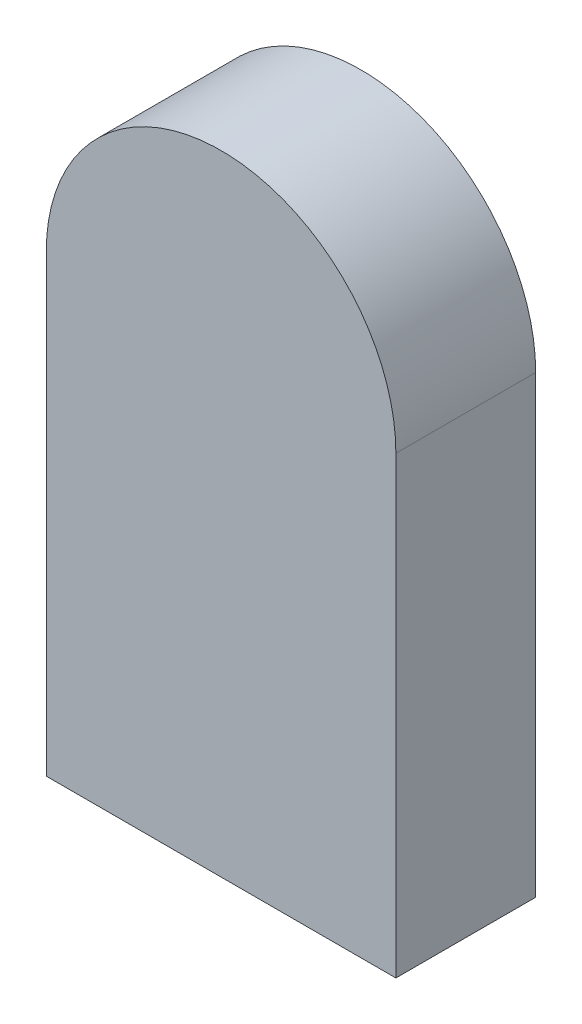
ISO-10303-21;
HEADER;
FILE_DESCRIPTION(('STEP AP214'),'2;1');
FILE_NAME('part.step','',(''),(''),'','','');
FILE_SCHEMA(('AUTOMOTIVE_DESIGN { 1 0 10303 214 1 1 1 1 }'));
ENDSEC;
DATA;
#1=APPLICATION_CONTEXT('core data for automotive mechanical design processes');
#2=APPLICATION_PROTOCOL_DEFINITION('international standard','automotive_design',2000,#1);
#3=PRODUCT_CONTEXT('',#1,'mechanical');
#4=PRODUCT('Part','Part','',(#3));
#5=PRODUCT_RELATED_PRODUCT_CATEGORY('part','',(#4));
#6=PRODUCT_DEFINITION_FORMATION('','',#4);
#7=PRODUCT_DEFINITION_CONTEXT('part definition',#1,'design');
#8=PRODUCT_DEFINITION('design','',#6,#7);
#9=PRODUCT_DEFINITION_SHAPE('','',#8);
#10=(LENGTH_UNIT() NAMED_UNIT(*) SI_UNIT(.MILLI.,.METRE.));
#11=(NAMED_UNIT(*) PLANE_ANGLE_UNIT() SI_UNIT($,.RADIAN.));
#12=(NAMED_UNIT(*) SI_UNIT($,.STERADIAN.) SOLID_ANGLE_UNIT());
#13=UNCERTAINTY_MEASURE_WITH_UNIT(LENGTH_MEASURE(1.E-05),#10,'distance_accuracy_value','');
#14=(GEOMETRIC_REPRESENTATION_CONTEXT(3) GLOBAL_UNCERTAINTY_ASSIGNED_CONTEXT((#13)) GLOBAL_UNIT_ASSIGNED_CONTEXT((#10,
#11,#12)) REPRESENTATION_CONTEXT('',''));
#15=CARTESIAN_POINT('',(0.,0.,0.));
#16=DIRECTION('',(0.,0.,1.));
#17=DIRECTION('',(1.,0.,0.));
#18=AXIS2_PLACEMENT_3D('',#15,#16,#17);
#19=CARTESIAN_POINT('',(0.125,-2.05,0.));
#20=DIRECTION('',(0.,1.,0.));
#21=DIRECTION('',(1.,0.,0.));
#22=AXIS2_PLACEMENT_3D('',#19,#20,#21);
#23=PLANE('',#22);
#24=DIRECTION('',(1.,0.,0.));
#25=VECTOR('',#24,1.);
#26=CARTESIAN_POINT('',(0.125,-2.05,0.));
#27=LINE('',#26,#25);
#28=CARTESIAN_POINT('',(0.125,-2.05,0.));
#29=VERTEX_POINT('',#28);
#30=CARTESIAN_POINT('',(0.375,-2.05,0.));
#31=VERTEX_POINT('',#30);
#32=EDGE_CURVE('E11',#29,#31,#27,.T.);
#33=ORIENTED_EDGE('',*,*,#32,.T.);
#34=DIRECTION('',(0.,0.,1.));
#35=VECTOR('',#34,1.);
#36=CARTESIAN_POINT('',(0.375,-2.05,0.));
#37=LINE('',#36,#35);
#38=CARTESIAN_POINT('',(0.375,-2.05,0.1));
#39=VERTEX_POINT('',#38);
#40=EDGE_CURVE('E24',#31,#39,#37,.T.);
#41=ORIENTED_EDGE('',*,*,#40,.T.);
#42=DIRECTION('',(1.,0.,0.));
#43=VECTOR('',#42,1.);
#44=CARTESIAN_POINT('',(0.125,-2.05,0.1));
#45=LINE('',#44,#43);
#46=CARTESIAN_POINT('',(0.125,-2.05,0.1));
#47=VERTEX_POINT('',#46);
#48=EDGE_CURVE('E87',#47,#39,#45,.T.);
#49=ORIENTED_EDGE('',*,*,#48,.F.);
#50=DIRECTION('',(0.,0.,1.));
#51=VECTOR('',#50,1.);
#52=CARTESIAN_POINT('',(0.125,-2.05,0.));
#53=LINE('',#52,#51);
#54=EDGE_CURVE('E36',#29,#47,#53,.T.);
#55=ORIENTED_EDGE('',*,*,#54,.F.);
#56=EDGE_LOOP('',(#33,#41,#49,#55));
#57=FACE_BOUND('',#56,.T.);
#58=ADVANCED_FACE('F17',(#57),#23,.F.);
#59=CARTESIAN_POINT('',(0.375,-2.05,0.));
#60=DIRECTION('',(-1.,0.,0.));
#61=DIRECTION('',(0.,1.,0.));
#62=AXIS2_PLACEMENT_3D('',#59,#60,#61);
#63=PLANE('',#62);
#64=DIRECTION('',(0.,1.,0.));
#65=VECTOR('',#64,1.);
#66=CARTESIAN_POINT('',(0.375,-2.05,0.));
#67=LINE('',#66,#65);
#68=CARTESIAN_POINT('',(0.375,-1.725,0.));
#69=VERTEX_POINT('',#68);
#70=EDGE_CURVE('E84',#31,#69,#67,.T.);
#71=ORIENTED_EDGE('',*,*,#70,.T.);
#72=DIRECTION('',(0.,0.,1.));
#73=VECTOR('',#72,1.);
#74=CARTESIAN_POINT('',(0.375,-1.725,0.));
#75=LINE('',#74,#73);
#76=CARTESIAN_POINT('',(0.375,-1.725,0.1));
#77=VERTEX_POINT('',#76);
#78=EDGE_CURVE('E82',#69,#77,#75,.T.);
#79=ORIENTED_EDGE('',*,*,#78,.T.);
#80=DIRECTION('',(0.,1.,0.));
#81=VECTOR('',#80,1.);
#82=CARTESIAN_POINT('',(0.375,-2.05,0.1));
#83=LINE('',#82,#81);
#84=EDGE_CURVE('E72',#39,#77,#83,.T.);
#85=ORIENTED_EDGE('',*,*,#84,.F.);
#86=ORIENTED_EDGE('',*,*,#40,.F.);
#87=EDGE_LOOP('',(#71,#79,#85,#86));
#88=FACE_BOUND('',#87,.T.);
#89=ADVANCED_FACE('F89',(#88),#63,.F.);
#90=CARTESIAN_POINT('',(0.25,-1.725,0.));
#91=DIRECTION('',(0.,0.,-1.));
#92=DIRECTION('',(1.,0.,0.));
#93=AXIS2_PLACEMENT_3D('',#90,#91,#92);
#94=CYLINDRICAL_SURFACE('',#93,0.125);
#95=CARTESIAN_POINT('',(0.25,-1.725,0.));
#96=DIRECTION('',(0.,0.,1.));
#97=DIRECTION('',(1.,0.,0.));
#98=AXIS2_PLACEMENT_3D('',#95,#96,#97);
#99=CIRCLE('',#98,0.125);
#100=CARTESIAN_POINT('',(0.125,-1.725,0.));
#101=VERTEX_POINT('',#100);
#102=EDGE_CURVE('E62',#69,#101,#99,.T.);
#103=ORIENTED_EDGE('',*,*,#102,.T.);
#104=DIRECTION('',(0.,0.,1.));
#105=VECTOR('',#104,1.);
#106=CARTESIAN_POINT('',(0.125,-1.725,0.));
#107=LINE('',#106,#105);
#108=CARTESIAN_POINT('',(0.125,-1.725,0.1));
#109=VERTEX_POINT('',#108);
#110=EDGE_CURVE('E57',#101,#109,#107,.T.);
#111=ORIENTED_EDGE('',*,*,#110,.T.);
#112=CARTESIAN_POINT('',(0.25,-1.725,0.1));
#113=DIRECTION('',(0.,0.,1.));
#114=DIRECTION('',(1.,0.,0.));
#115=AXIS2_PLACEMENT_3D('',#112,#113,#114);
#116=CIRCLE('',#115,0.125);
#117=EDGE_CURVE('E60',#77,#109,#116,.T.);
#118=ORIENTED_EDGE('',*,*,#117,.F.);
#119=ORIENTED_EDGE('',*,*,#78,.F.);
#120=EDGE_LOOP('',(#103,#111,#118,#119));
#121=FACE_BOUND('',#120,.T.);
#122=ADVANCED_FACE('F59',(#121),#94,.T.);
#123=CARTESIAN_POINT('',(0.125,-2.05,0.));
#124=DIRECTION('',(-1.,0.,0.));
#125=DIRECTION('',(0.,1.,0.));
#126=AXIS2_PLACEMENT_3D('',#123,#124,#125);
#127=PLANE('',#126);
#128=ORIENTED_EDGE('',*,*,#54,.T.);
#129=DIRECTION('',(0.,1.,0.));
#130=VECTOR('',#129,1.);
#131=CARTESIAN_POINT('',(0.125,-2.05,0.1));
#132=LINE('',#131,#130);
#133=EDGE_CURVE('E71',#47,#109,#132,.T.);
#134=ORIENTED_EDGE('',*,*,#133,.T.);
#135=ORIENTED_EDGE('',*,*,#110,.F.);
#136=DIRECTION('',(0.,1.,0.));
#137=VECTOR('',#136,1.);
#138=CARTESIAN_POINT('',(0.125,-2.05,0.));
#139=LINE('',#138,#137);
#140=EDGE_CURVE('E76',#29,#101,#139,.T.);
#141=ORIENTED_EDGE('',*,*,#140,.F.);
#142=EDGE_LOOP('',(#128,#134,#135,#141));
#143=FACE_BOUND('',#142,.T.);
#144=ADVANCED_FACE('F75',(#143),#127,.T.);
#145=CARTESIAN_POINT('',(0.25,-1.850342514613,0.));
#146=DIRECTION('',(0.,0.,1.));
#147=DIRECTION('',(1.,0.,0.));
#148=AXIS2_PLACEMENT_3D('',#145,#146,#147);
#149=PLANE('',#148);
#150=ORIENTED_EDGE('',*,*,#140,.T.);
#151=ORIENTED_EDGE('',*,*,#102,.F.);
#152=ORIENTED_EDGE('',*,*,#70,.F.);
#153=ORIENTED_EDGE('',*,*,#32,.F.);
#154=EDGE_LOOP('',(#150,#151,#152,#153));
#155=FACE_BOUND('',#154,.T.);
#156=ADVANCED_FACE('F91',(#155),#149,.F.);
#157=CARTESIAN_POINT('',(0.25,-1.850342514613,0.1));
#158=DIRECTION('',(0.,0.,1.));
#159=DIRECTION('',(1.,0.,0.));
#160=AXIS2_PLACEMENT_3D('',#157,#158,#159);
#161=PLANE('',#160);
#162=ORIENTED_EDGE('',*,*,#48,.T.);
#163=ORIENTED_EDGE('',*,*,#84,.T.);
#164=ORIENTED_EDGE('',*,*,#117,.T.);
#165=ORIENTED_EDGE('',*,*,#133,.F.);
#166=EDGE_LOOP('',(#162,#163,#164,#165));
#167=FACE_BOUND('',#166,.T.);
#168=ADVANCED_FACE('F70',(#167),#161,.T.);
#169=CLOSED_SHELL('',(#58,#89,#122,#144,#156,#168));
#170=MANIFOLD_SOLID_BREP('B1',#169);
#171=ADVANCED_BREP_SHAPE_REPRESENTATION('',(#18,#170),#14);
#172=SHAPE_DEFINITION_REPRESENTATION(#9,#171);
ENDSEC;
END-ISO-10303-21;
